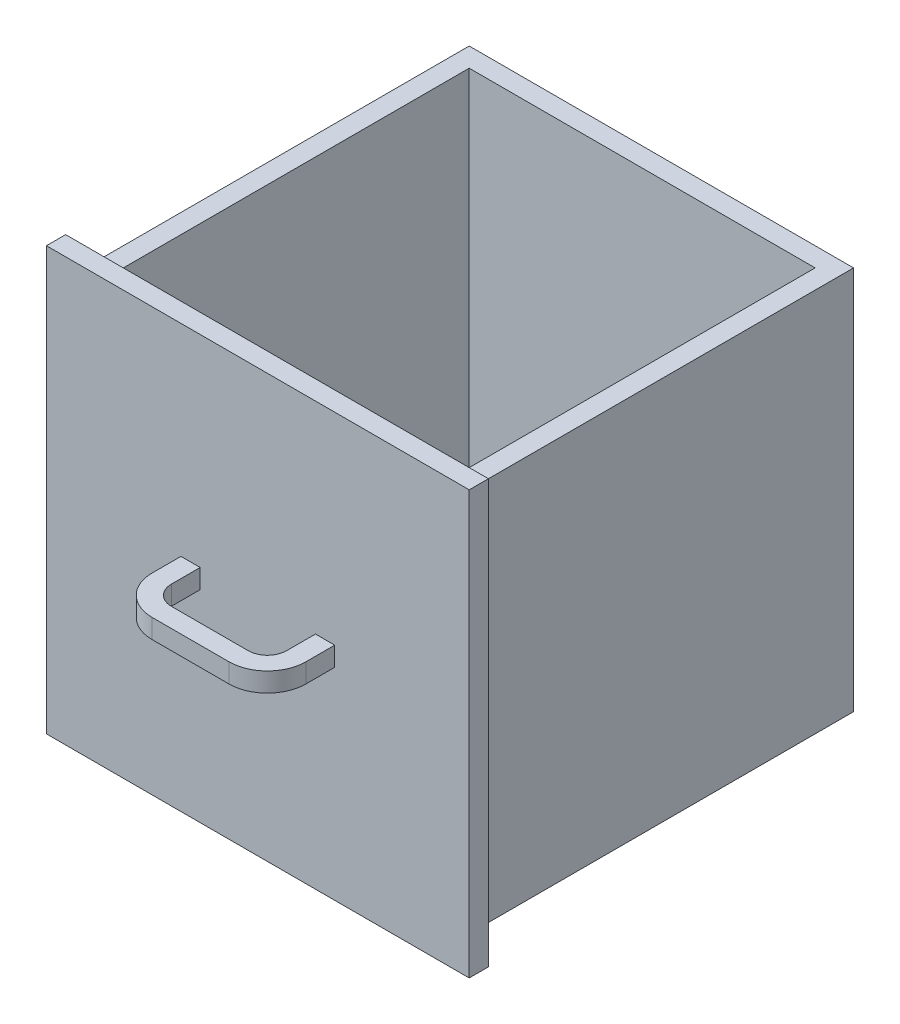
ISO-10303-21;
HEADER;
FILE_DESCRIPTION(('STEP AP214'),'2;1');
FILE_NAME('part.step','',(''),(''),'','','');
FILE_SCHEMA(('AUTOMOTIVE_DESIGN { 1 0 10303 214 1 1 1 1 }'));
ENDSEC;
DATA;
#1=APPLICATION_CONTEXT('core data for automotive mechanical design processes');
#2=APPLICATION_PROTOCOL_DEFINITION('international standard','automotive_design',2000,#1);
#3=PRODUCT_CONTEXT('',#1,'mechanical');
#4=PRODUCT('Part','Part','',(#3));
#5=PRODUCT_RELATED_PRODUCT_CATEGORY('part','',(#4));
#6=PRODUCT_DEFINITION_FORMATION('','',#4);
#7=PRODUCT_DEFINITION_CONTEXT('part definition',#1,'design');
#8=PRODUCT_DEFINITION('design','',#6,#7);
#9=PRODUCT_DEFINITION_SHAPE('','',#8);
#10=(LENGTH_UNIT() NAMED_UNIT(*) SI_UNIT(.MILLI.,.METRE.));
#11=(NAMED_UNIT(*) PLANE_ANGLE_UNIT() SI_UNIT($,.RADIAN.));
#12=(NAMED_UNIT(*) SI_UNIT($,.STERADIAN.) SOLID_ANGLE_UNIT());
#13=UNCERTAINTY_MEASURE_WITH_UNIT(LENGTH_MEASURE(1.E-05),#10,'distance_accuracy_value','');
#14=(GEOMETRIC_REPRESENTATION_CONTEXT(3) GLOBAL_UNCERTAINTY_ASSIGNED_CONTEXT((#13)) GLOBAL_UNIT_ASSIGNED_CONTEXT((#10,
#11,#12)) REPRESENTATION_CONTEXT('',''));
#15=CARTESIAN_POINT('',(0.,0.,0.));
#16=DIRECTION('',(0.,0.,1.));
#17=DIRECTION('',(1.,0.,0.));
#18=AXIS2_PLACEMENT_3D('',#15,#16,#17);
#19=CARTESIAN_POINT('',(0.,40.,40.));
#20=DIRECTION('',(0.,-1.,0.));
#21=DIRECTION('',(0.,0.,-1.));
#22=AXIS2_PLACEMENT_3D('',#19,#20,#21);
#23=PLANE('',#22);
#24=DIRECTION('',(-1.,0.,0.));
#25=VECTOR('',#24,1.);
#26=CARTESIAN_POINT('',(0.,40.,0.));
#27=LINE('',#26,#25);
#28=CARTESIAN_POINT('',(40.,40.,0.));
#29=VERTEX_POINT('',#28);
#30=CARTESIAN_POINT('',(0.,40.,0.));
#31=VERTEX_POINT('',#30);
#32=EDGE_CURVE('E361',#29,#31,#27,.T.);
#33=ORIENTED_EDGE('',*,*,#32,.T.);
#34=DIRECTION('',(0.,0.,-1.));
#35=VECTOR('',#34,1.);
#36=CARTESIAN_POINT('',(0.,40.,40.));
#37=LINE('',#36,#35);
#38=CARTESIAN_POINT('',(0.,40.,40.));
#39=VERTEX_POINT('',#38);
#40=EDGE_CURVE('E370',#39,#31,#37,.T.);
#41=ORIENTED_EDGE('',*,*,#40,.F.);
#42=DIRECTION('',(-1.,0.,0.));
#43=VECTOR('',#42,1.);
#44=CARTESIAN_POINT('',(0.,40.,40.));
#45=LINE('',#44,#43);
#46=CARTESIAN_POINT('',(40.,40.,40.));
#47=VERTEX_POINT('',#46);
#48=EDGE_CURVE('E367',#47,#39,#45,.T.);
#49=ORIENTED_EDGE('',*,*,#48,.F.);
#50=DIRECTION('',(0.,0.,-1.));
#51=VECTOR('',#50,1.);
#52=CARTESIAN_POINT('',(40.,40.,40.));
#53=LINE('',#52,#51);
#54=EDGE_CURVE('E380',#47,#29,#53,.T.);
#55=ORIENTED_EDGE('',*,*,#54,.T.);
#56=EDGE_LOOP('',(#33,#41,#49,#55));
#57=FACE_BOUND('',#56,.T.);
#58=DIRECTION('',(-1.,0.,0.));
#59=VECTOR('',#58,1.);
#60=CARTESIAN_POINT('',(0.,40.,2.));
#61=LINE('',#60,#59);
#62=CARTESIAN_POINT('',(38.,40.,2.));
#63=VERTEX_POINT('',#62);
#64=CARTESIAN_POINT('',(2.,40.,2.));
#65=VERTEX_POINT('',#64);
#66=EDGE_CURVE('E337',#63,#65,#61,.T.);
#67=ORIENTED_EDGE('',*,*,#66,.F.);
#68=DIRECTION('',(0.,0.,-1.));
#69=VECTOR('',#68,1.);
#70=CARTESIAN_POINT('',(38.,40.,40.));
#71=LINE('',#70,#69);
#72=CARTESIAN_POINT('',(38.,40.,38.));
#73=VERTEX_POINT('',#72);
#74=EDGE_CURVE('E342',#73,#63,#71,.T.);
#75=ORIENTED_EDGE('',*,*,#74,.F.);
#76=DIRECTION('',(-1.,0.,0.));
#77=VECTOR('',#76,1.);
#78=CARTESIAN_POINT('',(0.,40.,38.));
#79=LINE('',#78,#77);
#80=CARTESIAN_POINT('',(2.,40.,38.));
#81=VERTEX_POINT('',#80);
#82=EDGE_CURVE('E348',#73,#81,#79,.T.);
#83=ORIENTED_EDGE('',*,*,#82,.T.);
#84=DIRECTION('',(0.,0.,-1.));
#85=VECTOR('',#84,1.);
#86=CARTESIAN_POINT('',(2.,40.,40.));
#87=LINE('',#86,#85);
#88=EDGE_CURVE('E349',#81,#65,#87,.T.);
#89=ORIENTED_EDGE('',*,*,#88,.T.);
#90=EDGE_LOOP('',(#67,#75,#83,#89));
#91=FACE_BOUND('',#90,.T.);
#92=ADVANCED_FACE('F32',(#57,#91),#23,.F.);
#93=CARTESIAN_POINT('',(0.,0.,40.));
#94=DIRECTION('',(1.,0.,0.));
#95=DIRECTION('',(0.,0.,-1.));
#96=AXIS2_PLACEMENT_3D('',#93,#94,#95);
#97=PLANE('',#96);
#98=DIRECTION('',(0.,-1.,0.));
#99=VECTOR('',#98,1.);
#100=CARTESIAN_POINT('',(0.,0.,0.));
#101=LINE('',#100,#99);
#102=CARTESIAN_POINT('',(0.,0.,0.));
#103=VERTEX_POINT('',#102);
#104=EDGE_CURVE('E331',#31,#103,#101,.T.);
#105=ORIENTED_EDGE('',*,*,#104,.T.);
#106=DIRECTION('',(0.,0.,-1.));
#107=VECTOR('',#106,1.);
#108=CARTESIAN_POINT('',(0.,0.,40.));
#109=LINE('',#108,#107);
#110=CARTESIAN_POINT('',(0.,0.,40.));
#111=VERTEX_POINT('',#110);
#112=EDGE_CURVE('E11',#111,#103,#109,.T.);
#113=ORIENTED_EDGE('',*,*,#112,.F.);
#114=DIRECTION('',(0.,-1.,0.));
#115=VECTOR('',#114,1.);
#116=CARTESIAN_POINT('',(0.,0.,40.));
#117=LINE('',#116,#115);
#118=EDGE_CURVE('E357',#39,#111,#117,.T.);
#119=ORIENTED_EDGE('',*,*,#118,.F.);
#120=ORIENTED_EDGE('',*,*,#40,.T.);
#121=EDGE_LOOP('',(#105,#113,#119,#120));
#122=FACE_BOUND('',#121,.T.);
#123=ADVANCED_FACE('F34',(#122),#97,.F.);
#124=CARTESIAN_POINT('',(0.,0.,40.));
#125=DIRECTION('',(0.,1.,0.));
#126=DIRECTION('',(0.,0.,1.));
#127=AXIS2_PLACEMENT_3D('',#124,#125,#126);
#128=PLANE('',#127);
#129=DIRECTION('',(1.,0.,0.));
#130=VECTOR('',#129,1.);
#131=CARTESIAN_POINT('',(0.,0.,0.));
#132=LINE('',#131,#130);
#133=CARTESIAN_POINT('',(40.,0.,0.));
#134=VERTEX_POINT('',#133);
#135=EDGE_CURVE('E373',#103,#134,#132,.T.);
#136=ORIENTED_EDGE('',*,*,#135,.T.);
#137=DIRECTION('',(0.,0.,-1.));
#138=VECTOR('',#137,1.);
#139=CARTESIAN_POINT('',(40.,0.,40.));
#140=LINE('',#139,#138);
#141=CARTESIAN_POINT('',(40.,0.,40.));
#142=VERTEX_POINT('',#141);
#143=EDGE_CURVE('E40',#142,#134,#140,.T.);
#144=ORIENTED_EDGE('',*,*,#143,.F.);
#145=DIRECTION('',(1.,0.,0.));
#146=VECTOR('',#145,1.);
#147=CARTESIAN_POINT('',(0.,0.,40.));
#148=LINE('',#147,#146);
#149=EDGE_CURVE('E360',#111,#142,#148,.T.);
#150=ORIENTED_EDGE('',*,*,#149,.F.);
#151=ORIENTED_EDGE('',*,*,#112,.T.);
#152=EDGE_LOOP('',(#136,#144,#150,#151));
#153=FACE_BOUND('',#152,.T.);
#154=ADVANCED_FACE('F400',(#153),#128,.F.);
#155=CARTESIAN_POINT('',(40.,0.,40.));
#156=DIRECTION('',(-1.,0.,0.));
#157=DIRECTION('',(0.,0.,1.));
#158=AXIS2_PLACEMENT_3D('',#155,#156,#157);
#159=PLANE('',#158);
#160=DIRECTION('',(0.,1.,0.));
#161=VECTOR('',#160,1.);
#162=CARTESIAN_POINT('',(40.,0.,0.));
#163=LINE('',#162,#161);
#164=EDGE_CURVE('E375',#134,#29,#163,.T.);
#165=ORIENTED_EDGE('',*,*,#164,.T.);
#166=ORIENTED_EDGE('',*,*,#54,.F.);
#167=DIRECTION('',(0.,1.,0.));
#168=VECTOR('',#167,1.);
#169=CARTESIAN_POINT('',(40.,0.,40.));
#170=LINE('',#169,#168);
#171=EDGE_CURVE('E364',#142,#47,#170,.T.);
#172=ORIENTED_EDGE('',*,*,#171,.F.);
#173=ORIENTED_EDGE('',*,*,#143,.T.);
#174=EDGE_LOOP('',(#165,#166,#172,#173));
#175=FACE_BOUND('',#174,.T.);
#176=ADVANCED_FACE('F386',(#175),#159,.F.);
#177=CARTESIAN_POINT('',(0.,0.,0.));
#178=DIRECTION('',(0.,0.,-1.));
#179=DIRECTION('',(-1.,0.,0.));
#180=AXIS2_PLACEMENT_3D('',#177,#178,#179);
#181=PLANE('',#180);
#182=ORIENTED_EDGE('',*,*,#104,.F.);
#183=ORIENTED_EDGE('',*,*,#32,.F.);
#184=ORIENTED_EDGE('',*,*,#164,.F.);
#185=ORIENTED_EDGE('',*,*,#135,.F.);
#186=EDGE_LOOP('',(#182,#183,#184,#185));
#187=FACE_BOUND('',#186,.T.);
#188=ADVANCED_FACE('F392',(#187),#181,.T.);
#189=CARTESIAN_POINT('',(2.,0.,40.));
#190=DIRECTION('',(1.,0.,0.));
#191=DIRECTION('',(0.,0.,-1.));
#192=AXIS2_PLACEMENT_3D('',#189,#190,#191);
#193=PLANE('',#192);
#194=DIRECTION('',(0.,-1.,0.));
#195=VECTOR('',#194,1.);
#196=CARTESIAN_POINT('',(2.,0.,2.));
#197=LINE('',#196,#195);
#198=CARTESIAN_POINT('',(2.,2.,2.));
#199=VERTEX_POINT('',#198);
#200=EDGE_CURVE('E324',#65,#199,#197,.T.);
#201=ORIENTED_EDGE('',*,*,#200,.F.);
#202=ORIENTED_EDGE('',*,*,#88,.F.);
#203=DIRECTION('',(0.,-1.,0.));
#204=VECTOR('',#203,1.);
#205=CARTESIAN_POINT('',(2.,0.,38.));
#206=LINE('',#205,#204);
#207=CARTESIAN_POINT('',(2.,2.,38.));
#208=VERTEX_POINT('',#207);
#209=EDGE_CURVE('E333',#81,#208,#206,.T.);
#210=ORIENTED_EDGE('',*,*,#209,.T.);
#211=DIRECTION('',(0.,0.,-1.));
#212=VECTOR('',#211,1.);
#213=CARTESIAN_POINT('',(2.,2.,40.));
#214=LINE('',#213,#212);
#215=EDGE_CURVE('E328',#208,#199,#214,.T.);
#216=ORIENTED_EDGE('',*,*,#215,.T.);
#217=EDGE_LOOP('',(#201,#202,#210,#216));
#218=FACE_BOUND('',#217,.T.);
#219=ADVANCED_FACE('F414',(#218),#193,.T.);
#220=CARTESIAN_POINT('',(0.,2.,40.));
#221=DIRECTION('',(0.,1.,0.));
#222=DIRECTION('',(0.,0.,1.));
#223=AXIS2_PLACEMENT_3D('',#220,#221,#222);
#224=PLANE('',#223);
#225=DIRECTION('',(1.,0.,0.));
#226=VECTOR('',#225,1.);
#227=CARTESIAN_POINT('',(0.,2.,2.));
#228=LINE('',#227,#226);
#229=CARTESIAN_POINT('',(38.,2.,2.));
#230=VERTEX_POINT('',#229);
#231=EDGE_CURVE('E327',#199,#230,#228,.T.);
#232=ORIENTED_EDGE('',*,*,#231,.F.);
#233=ORIENTED_EDGE('',*,*,#215,.F.);
#234=DIRECTION('',(1.,0.,0.));
#235=VECTOR('',#234,1.);
#236=CARTESIAN_POINT('',(0.,2.,38.));
#237=LINE('',#236,#235);
#238=CARTESIAN_POINT('',(38.,2.,38.));
#239=VERTEX_POINT('',#238);
#240=EDGE_CURVE('E336',#208,#239,#237,.T.);
#241=ORIENTED_EDGE('',*,*,#240,.T.);
#242=DIRECTION('',(0.,0.,-1.));
#243=VECTOR('',#242,1.);
#244=CARTESIAN_POINT('',(38.,2.,40.));
#245=LINE('',#244,#243);
#246=EDGE_CURVE('E332',#239,#230,#245,.T.);
#247=ORIENTED_EDGE('',*,*,#246,.T.);
#248=EDGE_LOOP('',(#232,#233,#241,#247));
#249=FACE_BOUND('',#248,.T.);
#250=ADVANCED_FACE('F426',(#249),#224,.T.);
#251=CARTESIAN_POINT('',(38.,0.,40.));
#252=DIRECTION('',(-1.,0.,0.));
#253=DIRECTION('',(0.,0.,1.));
#254=AXIS2_PLACEMENT_3D('',#251,#252,#253);
#255=PLANE('',#254);
#256=DIRECTION('',(0.,1.,0.));
#257=VECTOR('',#256,1.);
#258=CARTESIAN_POINT('',(38.,0.,2.));
#259=LINE('',#258,#257);
#260=EDGE_CURVE('E339',#230,#63,#259,.T.);
#261=ORIENTED_EDGE('',*,*,#260,.F.);
#262=ORIENTED_EDGE('',*,*,#246,.F.);
#263=DIRECTION('',(0.,1.,0.));
#264=VECTOR('',#263,1.);
#265=CARTESIAN_POINT('',(38.,0.,38.));
#266=LINE('',#265,#264);
#267=EDGE_CURVE('E344',#239,#73,#266,.T.);
#268=ORIENTED_EDGE('',*,*,#267,.T.);
#269=ORIENTED_EDGE('',*,*,#74,.T.);
#270=EDGE_LOOP('',(#261,#262,#268,#269));
#271=FACE_BOUND('',#270,.T.);
#272=ADVANCED_FACE('F422',(#271),#255,.T.);
#273=CARTESIAN_POINT('',(0.,0.,38.));
#274=DIRECTION('',(0.,0.,-1.));
#275=DIRECTION('',(-1.,0.,0.));
#276=AXIS2_PLACEMENT_3D('',#273,#274,#275);
#277=PLANE('',#276);
#278=ORIENTED_EDGE('',*,*,#209,.F.);
#279=ORIENTED_EDGE('',*,*,#82,.F.);
#280=ORIENTED_EDGE('',*,*,#267,.F.);
#281=ORIENTED_EDGE('',*,*,#240,.F.);
#282=EDGE_LOOP('',(#278,#279,#280,#281));
#283=FACE_BOUND('',#282,.T.);
#284=ADVANCED_FACE('F418',(#283),#277,.T.);
#285=CARTESIAN_POINT('',(0.,0.,2.));
#286=DIRECTION('',(0.,0.,-1.));
#287=DIRECTION('',(-1.,0.,0.));
#288=AXIS2_PLACEMENT_3D('',#285,#286,#287);
#289=PLANE('',#288);
#290=ORIENTED_EDGE('',*,*,#200,.T.);
#291=ORIENTED_EDGE('',*,*,#231,.T.);
#292=ORIENTED_EDGE('',*,*,#260,.T.);
#293=ORIENTED_EDGE('',*,*,#66,.T.);
#294=EDGE_LOOP('',(#290,#291,#292,#293));
#295=FACE_BOUND('',#294,.T.);
#296=ADVANCED_FACE('F415',(#295),#289,.F.);
#297=CARTESIAN_POINT('',(0.,0.,40.));
#298=DIRECTION('',(0.,0.,1.));
#299=DIRECTION('',(1.,0.,0.));
#300=AXIS2_PLACEMENT_3D('',#297,#298,#299);
#301=PLANE('',#300);
#302=DIRECTION('',(-1.,0.,0.));
#303=VECTOR('',#302,1.);
#304=CARTESIAN_POINT('',(42.,42.,40.));
#305=LINE('',#304,#303);
#306=CARTESIAN_POINT('',(42.,42.,40.));
#307=VERTEX_POINT('',#306);
#308=CARTESIAN_POINT('',(-2.,42.,40.));
#309=VERTEX_POINT('',#308);
#310=EDGE_CURVE('E215',#307,#309,#305,.T.);
#311=ORIENTED_EDGE('',*,*,#310,.F.);
#312=DIRECTION('',(0.,1.,0.));
#313=VECTOR('',#312,1.);
#314=CARTESIAN_POINT('',(42.,-2.,40.));
#315=LINE('',#314,#313);
#316=CARTESIAN_POINT('',(42.,-2.,40.));
#317=VERTEX_POINT('',#316);
#318=EDGE_CURVE('E299',#317,#307,#315,.T.);
#319=ORIENTED_EDGE('',*,*,#318,.F.);
#320=DIRECTION('',(1.,0.,0.));
#321=VECTOR('',#320,1.);
#322=CARTESIAN_POINT('',(-2.,-2.,40.));
#323=LINE('',#322,#321);
#324=CARTESIAN_POINT('',(-2.,-2.,40.));
#325=VERTEX_POINT('',#324);
#326=EDGE_CURVE('E310',#325,#317,#323,.T.);
#327=ORIENTED_EDGE('',*,*,#326,.F.);
#328=DIRECTION('',(0.,-1.,0.));
#329=VECTOR('',#328,1.);
#330=CARTESIAN_POINT('',(-2.,42.,40.));
#331=LINE('',#330,#329);
#332=EDGE_CURVE('E308',#309,#325,#331,.T.);
#333=ORIENTED_EDGE('',*,*,#332,.F.);
#334=EDGE_LOOP('',(#311,#319,#327,#333));
#335=FACE_BOUND('',#334,.T.);
#336=ORIENTED_EDGE('',*,*,#171,.T.);
#337=ORIENTED_EDGE('',*,*,#48,.T.);
#338=ORIENTED_EDGE('',*,*,#118,.T.);
#339=ORIENTED_EDGE('',*,*,#149,.T.);
#340=EDGE_LOOP('',(#336,#337,#338,#339));
#341=FACE_BOUND('',#340,.T.);
#342=ADVANCED_FACE('F399',(#335,#341),#301,.F.);
#343=CARTESIAN_POINT('',(42.,42.,42.));
#344=DIRECTION('',(0.,-1.,0.));
#345=DIRECTION('',(0.,0.,-1.));
#346=AXIS2_PLACEMENT_3D('',#343,#344,#345);
#347=PLANE('',#346);
#348=ORIENTED_EDGE('',*,*,#310,.T.);
#349=DIRECTION('',(0.,0.,-1.));
#350=VECTOR('',#349,1.);
#351=CARTESIAN_POINT('',(-2.,42.,42.));
#352=LINE('',#351,#350);
#353=CARTESIAN_POINT('',(-2.,42.,42.));
#354=VERTEX_POINT('',#353);
#355=EDGE_CURVE('E321',#354,#309,#352,.T.);
#356=ORIENTED_EDGE('',*,*,#355,.F.);
#357=DIRECTION('',(-1.,0.,0.));
#358=VECTOR('',#357,1.);
#359=CARTESIAN_POINT('',(42.,42.,42.));
#360=LINE('',#359,#358);
#361=CARTESIAN_POINT('',(42.,42.,42.));
#362=VERTEX_POINT('',#361);
#363=EDGE_CURVE('E295',#362,#354,#360,.T.);
#364=ORIENTED_EDGE('',*,*,#363,.F.);
#365=DIRECTION('',(0.,0.,-1.));
#366=VECTOR('',#365,1.);
#367=CARTESIAN_POINT('',(42.,42.,42.));
#368=LINE('',#367,#366);
#369=EDGE_CURVE('E305',#362,#307,#368,.T.);
#370=ORIENTED_EDGE('',*,*,#369,.T.);
#371=EDGE_LOOP('',(#348,#356,#364,#370));
#372=FACE_BOUND('',#371,.T.);
#373=ADVANCED_FACE('F434',(#372),#347,.F.);
#374=CARTESIAN_POINT('',(-2.,42.,42.));
#375=DIRECTION('',(1.,0.,0.));
#376=DIRECTION('',(0.,0.,-1.));
#377=AXIS2_PLACEMENT_3D('',#374,#375,#376);
#378=PLANE('',#377);
#379=ORIENTED_EDGE('',*,*,#332,.T.);
#380=DIRECTION('',(0.,0.,-1.));
#381=VECTOR('',#380,1.);
#382=CARTESIAN_POINT('',(-2.,-2.,42.));
#383=LINE('',#382,#381);
#384=CARTESIAN_POINT('',(-2.,-2.,42.));
#385=VERTEX_POINT('',#384);
#386=EDGE_CURVE('E318',#385,#325,#383,.T.);
#387=ORIENTED_EDGE('',*,*,#386,.F.);
#388=DIRECTION('',(0.,-1.,0.));
#389=VECTOR('',#388,1.);
#390=CARTESIAN_POINT('',(-2.,42.,42.));
#391=LINE('',#390,#389);
#392=EDGE_CURVE('E298',#354,#385,#391,.T.);
#393=ORIENTED_EDGE('',*,*,#392,.F.);
#394=ORIENTED_EDGE('',*,*,#355,.T.);
#395=EDGE_LOOP('',(#379,#387,#393,#394));
#396=FACE_BOUND('',#395,.T.);
#397=ADVANCED_FACE('F437',(#396),#378,.F.);
#398=CARTESIAN_POINT('',(-2.,-2.,42.));
#399=DIRECTION('',(0.,1.,0.));
#400=DIRECTION('',(0.,0.,1.));
#401=AXIS2_PLACEMENT_3D('',#398,#399,#400);
#402=PLANE('',#401);
#403=ORIENTED_EDGE('',*,*,#326,.T.);
#404=DIRECTION('',(0.,0.,-1.));
#405=VECTOR('',#404,1.);
#406=CARTESIAN_POINT('',(42.,-2.,42.));
#407=LINE('',#406,#405);
#408=CARTESIAN_POINT('',(42.,-2.,42.));
#409=VERTEX_POINT('',#408);
#410=EDGE_CURVE('E315',#409,#317,#407,.T.);
#411=ORIENTED_EDGE('',*,*,#410,.F.);
#412=DIRECTION('',(1.,0.,0.));
#413=VECTOR('',#412,1.);
#414=CARTESIAN_POINT('',(-2.,-2.,42.));
#415=LINE('',#414,#413);
#416=EDGE_CURVE('E301',#385,#409,#415,.T.);
#417=ORIENTED_EDGE('',*,*,#416,.F.);
#418=ORIENTED_EDGE('',*,*,#386,.T.);
#419=EDGE_LOOP('',(#403,#411,#417,#418));
#420=FACE_BOUND('',#419,.T.);
#421=ADVANCED_FACE('F441',(#420),#402,.F.);
#422=CARTESIAN_POINT('',(42.,-2.,42.));
#423=DIRECTION('',(-1.,0.,0.));
#424=DIRECTION('',(0.,0.,1.));
#425=AXIS2_PLACEMENT_3D('',#422,#423,#424);
#426=PLANE('',#425);
#427=ORIENTED_EDGE('',*,*,#318,.T.);
#428=ORIENTED_EDGE('',*,*,#369,.F.);
#429=DIRECTION('',(0.,1.,0.));
#430=VECTOR('',#429,1.);
#431=CARTESIAN_POINT('',(42.,-2.,42.));
#432=LINE('',#431,#430);
#433=EDGE_CURVE('E303',#409,#362,#432,.T.);
#434=ORIENTED_EDGE('',*,*,#433,.F.);
#435=ORIENTED_EDGE('',*,*,#410,.T.);
#436=EDGE_LOOP('',(#427,#428,#434,#435));
#437=FACE_BOUND('',#436,.T.);
#438=ADVANCED_FACE('F445',(#437),#426,.F.);
#439=CARTESIAN_POINT('',(0.,0.,42.));
#440=DIRECTION('',(0.,0.,1.));
#441=DIRECTION('',(1.,0.,0.));
#442=AXIS2_PLACEMENT_3D('',#439,#440,#441);
#443=PLANE('',#442);
#444=DIRECTION('',(1.,0.,0.));
#445=VECTOR('',#444,1.);
#446=CARTESIAN_POINT('',(26.,21.,42.));
#447=LINE('',#446,#445);
#448=CARTESIAN_POINT('',(26.,21.,42.));
#449=VERTEX_POINT('',#448);
#450=CARTESIAN_POINT('',(28.,21.,42.));
#451=VERTEX_POINT('',#450);
#452=EDGE_CURVE('E199',#449,#451,#447,.T.);
#453=ORIENTED_EDGE('',*,*,#452,.T.);
#454=DIRECTION('',(0.,-1.,0.));
#455=VECTOR('',#454,1.);
#456=CARTESIAN_POINT('',(28.,21.,42.));
#457=LINE('',#456,#455);
#458=CARTESIAN_POINT('',(28.,19.,42.));
#459=VERTEX_POINT('',#458);
#460=EDGE_CURVE('E209',#451,#459,#457,.T.);
#461=ORIENTED_EDGE('',*,*,#460,.T.);
#462=DIRECTION('',(1.,0.,0.));
#463=VECTOR('',#462,1.);
#464=CARTESIAN_POINT('',(26.,19.,42.));
#465=LINE('',#464,#463);
#466=CARTESIAN_POINT('',(26.,19.,42.));
#467=VERTEX_POINT('',#466);
#468=EDGE_CURVE('E249',#467,#459,#465,.T.);
#469=ORIENTED_EDGE('',*,*,#468,.F.);
#470=DIRECTION('',(0.,-1.,0.));
#471=VECTOR('',#470,1.);
#472=CARTESIAN_POINT('',(26.,21.,42.));
#473=LINE('',#472,#471);
#474=EDGE_CURVE('E216',#449,#467,#473,.T.);
#475=ORIENTED_EDGE('',*,*,#474,.F.);
#476=EDGE_LOOP('',(#453,#461,#469,#475));
#477=FACE_BOUND('',#476,.T.);
#478=DIRECTION('',(1.,0.,0.));
#479=VECTOR('',#478,1.);
#480=CARTESIAN_POINT('',(12.,21.,42.));
#481=LINE('',#480,#479);
#482=CARTESIAN_POINT('',(12.,21.,42.));
#483=VERTEX_POINT('',#482);
#484=CARTESIAN_POINT('',(14.,21.,42.));
#485=VERTEX_POINT('',#484);
#486=EDGE_CURVE('E237',#483,#485,#481,.T.);
#487=ORIENTED_EDGE('',*,*,#486,.T.);
#488=DIRECTION('',(0.,-1.,0.));
#489=VECTOR('',#488,1.);
#490=CARTESIAN_POINT('',(14.,21.,42.));
#491=LINE('',#490,#489);
#492=CARTESIAN_POINT('',(14.,19.,42.));
#493=VERTEX_POINT('',#492);
#494=EDGE_CURVE('E283',#485,#493,#491,.T.);
#495=ORIENTED_EDGE('',*,*,#494,.T.);
#496=DIRECTION('',(1.,0.,0.));
#497=VECTOR('',#496,1.);
#498=CARTESIAN_POINT('',(12.,19.,42.));
#499=LINE('',#498,#497);
#500=CARTESIAN_POINT('',(12.,19.,42.));
#501=VERTEX_POINT('',#500);
#502=EDGE_CURVE('E263',#501,#493,#499,.T.);
#503=ORIENTED_EDGE('',*,*,#502,.F.);
#504=DIRECTION('',(0.,-1.,0.));
#505=VECTOR('',#504,1.);
#506=CARTESIAN_POINT('',(12.,21.,42.));
#507=LINE('',#506,#505);
#508=EDGE_CURVE('E281',#483,#501,#507,.T.);
#509=ORIENTED_EDGE('',*,*,#508,.F.);
#510=EDGE_LOOP('',(#487,#495,#503,#509));
#511=FACE_BOUND('',#510,.T.);
#512=ORIENTED_EDGE('',*,*,#363,.T.);
#513=ORIENTED_EDGE('',*,*,#392,.T.);
#514=ORIENTED_EDGE('',*,*,#416,.T.);
#515=ORIENTED_EDGE('',*,*,#433,.T.);
#516=EDGE_LOOP('',(#512,#513,#514,#515));
#517=FACE_BOUND('',#516,.T.);
#518=ADVANCED_FACE('F219',(#477,#511,#517),#443,.T.);
#519=CARTESIAN_POINT('',(28.,21.,45.));
#520=DIRECTION('',(-1.,0.,0.));
#521=DIRECTION('',(0.,0.,1.));
#522=AXIS2_PLACEMENT_3D('',#519,#520,#521);
#523=PLANE('',#522);
#524=DIRECTION('',(0.,0.,-1.));
#525=VECTOR('',#524,1.);
#526=CARTESIAN_POINT('',(28.,19.,45.));
#527=LINE('',#526,#525);
#528=CARTESIAN_POINT('',(28.,19.,45.));
#529=VERTEX_POINT('',#528);
#530=EDGE_CURVE('E212',#529,#459,#527,.T.);
#531=ORIENTED_EDGE('',*,*,#530,.T.);
#532=ORIENTED_EDGE('',*,*,#460,.F.);
#533=DIRECTION('',(0.,0.,-1.));
#534=VECTOR('',#533,1.);
#535=CARTESIAN_POINT('',(28.,21.,45.));
#536=LINE('',#535,#534);
#537=CARTESIAN_POINT('',(28.,21.,45.));
#538=VERTEX_POINT('',#537);
#539=EDGE_CURVE('E194',#538,#451,#536,.T.);
#540=ORIENTED_EDGE('',*,*,#539,.F.);
#541=DIRECTION('',(0.,-1.,0.));
#542=VECTOR('',#541,1.);
#543=CARTESIAN_POINT('',(28.,21.,45.));
#544=LINE('',#543,#542);
#545=EDGE_CURVE('E247',#538,#529,#544,.T.);
#546=ORIENTED_EDGE('',*,*,#545,.T.);
#547=EDGE_LOOP('',(#531,#532,#540,#546));
#548=FACE_BOUND('',#547,.T.);
#549=ADVANCED_FACE('F210',(#548),#523,.F.);
#550=CARTESIAN_POINT('',(26.,21.,45.));
#551=DIRECTION('',(-1.,0.,0.));
#552=DIRECTION('',(0.,0.,1.));
#553=AXIS2_PLACEMENT_3D('',#550,#551,#552);
#554=PLANE('',#553);
#555=DIRECTION('',(0.,0.,-1.));
#556=VECTOR('',#555,1.);
#557=CARTESIAN_POINT('',(26.,19.,45.));
#558=LINE('',#557,#556);
#559=CARTESIAN_POINT('',(26.,19.,45.));
#560=VERTEX_POINT('',#559);
#561=EDGE_CURVE('E47',#560,#467,#558,.T.);
#562=ORIENTED_EDGE('',*,*,#561,.F.);
#563=DIRECTION('',(0.,-1.,0.));
#564=VECTOR('',#563,1.);
#565=CARTESIAN_POINT('',(26.,21.,45.));
#566=LINE('',#565,#564);
#567=CARTESIAN_POINT('',(26.,21.,45.));
#568=VERTEX_POINT('',#567);
#569=EDGE_CURVE('E292',#568,#560,#566,.T.);
#570=ORIENTED_EDGE('',*,*,#569,.F.);
#571=DIRECTION('',(0.,0.,-1.));
#572=VECTOR('',#571,1.);
#573=CARTESIAN_POINT('',(26.,21.,45.));
#574=LINE('',#573,#572);
#575=EDGE_CURVE('E221',#568,#449,#574,.T.);
#576=ORIENTED_EDGE('',*,*,#575,.T.);
#577=ORIENTED_EDGE('',*,*,#474,.T.);
#578=EDGE_LOOP('',(#562,#570,#576,#577));
#579=FACE_BOUND('',#578,.T.);
#580=ADVANCED_FACE('F457',(#579),#554,.T.);
#581=CARTESIAN_POINT('',(24.,21.,45.));
#582=DIRECTION('',(0.,-1.,0.));
#583=DIRECTION('',(0.,0.,-1.));
#584=AXIS2_PLACEMENT_3D('',#581,#582,#583);
#585=CYLINDRICAL_SURFACE('',#584,2.);
#586=CARTESIAN_POINT('',(24.,19.,45.));
#587=DIRECTION('',(0.,1.,0.));
#588=DIRECTION('',(0.,0.,1.));
#589=AXIS2_PLACEMENT_3D('',#586,#587,#588);
#590=CIRCLE('',#589,2.);
#591=CARTESIAN_POINT('',(24.,19.,47.));
#592=VERTEX_POINT('',#591);
#593=EDGE_CURVE('E252',#592,#560,#590,.T.);
#594=ORIENTED_EDGE('',*,*,#593,.F.);
#595=DIRECTION('',(0.,-1.,0.));
#596=VECTOR('',#595,1.);
#597=CARTESIAN_POINT('',(24.,21.,47.));
#598=LINE('',#597,#596);
#599=CARTESIAN_POINT('',(24.,21.,47.));
#600=VERTEX_POINT('',#599);
#601=EDGE_CURVE('E290',#600,#592,#598,.T.);
#602=ORIENTED_EDGE('',*,*,#601,.F.);
#603=CARTESIAN_POINT('',(24.,21.,45.));
#604=DIRECTION('',(0.,1.,0.));
#605=DIRECTION('',(0.,0.,1.));
#606=AXIS2_PLACEMENT_3D('',#603,#604,#605);
#607=CIRCLE('',#606,2.);
#608=EDGE_CURVE('E223',#600,#568,#607,.T.);
#609=ORIENTED_EDGE('',*,*,#608,.T.);
#610=ORIENTED_EDGE('',*,*,#569,.T.);
#611=EDGE_LOOP('',(#594,#602,#609,#610));
#612=FACE_BOUND('',#611,.T.);
#613=ADVANCED_FACE('F460',(#612),#585,.F.);
#614=CARTESIAN_POINT('',(16.,21.,47.));
#615=DIRECTION('',(0.,0.,-1.));
#616=DIRECTION('',(-1.,0.,0.));
#617=AXIS2_PLACEMENT_3D('',#614,#615,#616);
#618=PLANE('',#617);
#619=DIRECTION('',(1.,0.,0.));
#620=VECTOR('',#619,1.);
#621=CARTESIAN_POINT('',(16.,19.,47.));
#622=LINE('',#621,#620);
#623=CARTESIAN_POINT('',(16.,19.,47.));
#624=VERTEX_POINT('',#623);
#625=EDGE_CURVE('E254',#624,#592,#622,.T.);
#626=ORIENTED_EDGE('',*,*,#625,.F.);
#627=DIRECTION('',(0.,-1.,0.));
#628=VECTOR('',#627,1.);
#629=CARTESIAN_POINT('',(16.,21.,47.));
#630=LINE('',#629,#628);
#631=CARTESIAN_POINT('',(16.,21.,47.));
#632=VERTEX_POINT('',#631);
#633=EDGE_CURVE('E288',#632,#624,#630,.T.);
#634=ORIENTED_EDGE('',*,*,#633,.F.);
#635=DIRECTION('',(1.,0.,0.));
#636=VECTOR('',#635,1.);
#637=CARTESIAN_POINT('',(16.,21.,47.));
#638=LINE('',#637,#636);
#639=EDGE_CURVE('E228',#632,#600,#638,.T.);
#640=ORIENTED_EDGE('',*,*,#639,.T.);
#641=ORIENTED_EDGE('',*,*,#601,.T.);
#642=EDGE_LOOP('',(#626,#634,#640,#641));
#643=FACE_BOUND('',#642,.T.);
#644=ADVANCED_FACE('F464',(#643),#618,.T.);
#645=CARTESIAN_POINT('',(16.,21.,45.));
#646=DIRECTION('',(0.,-1.,0.));
#647=DIRECTION('',(0.,0.,-1.));
#648=AXIS2_PLACEMENT_3D('',#645,#646,#647);
#649=CYLINDRICAL_SURFACE('',#648,2.);
#650=CARTESIAN_POINT('',(16.,19.,45.));
#651=DIRECTION('',(0.,1.,0.));
#652=DIRECTION('',(0.,0.,1.));
#653=AXIS2_PLACEMENT_3D('',#650,#651,#652);
#654=CIRCLE('',#653,2.);
#655=CARTESIAN_POINT('',(14.,19.,45.));
#656=VERTEX_POINT('',#655);
#657=EDGE_CURVE('E257',#656,#624,#654,.T.);
#658=ORIENTED_EDGE('',*,*,#657,.F.);
#659=DIRECTION('',(0.,-1.,0.));
#660=VECTOR('',#659,1.);
#661=CARTESIAN_POINT('',(14.,21.,45.));
#662=LINE('',#661,#660);
#663=CARTESIAN_POINT('',(14.,21.,45.));
#664=VERTEX_POINT('',#663);
#665=EDGE_CURVE('E286',#664,#656,#662,.T.);
#666=ORIENTED_EDGE('',*,*,#665,.F.);
#667=CARTESIAN_POINT('',(16.,21.,45.));
#668=DIRECTION('',(0.,1.,0.));
#669=DIRECTION('',(0.,0.,1.));
#670=AXIS2_PLACEMENT_3D('',#667,#668,#669);
#671=CIRCLE('',#670,2.);
#672=EDGE_CURVE('E231',#664,#632,#671,.T.);
#673=ORIENTED_EDGE('',*,*,#672,.T.);
#674=ORIENTED_EDGE('',*,*,#633,.T.);
#675=EDGE_LOOP('',(#658,#666,#673,#674));
#676=FACE_BOUND('',#675,.T.);
#677=ADVANCED_FACE('F468',(#676),#649,.F.);
#678=CARTESIAN_POINT('',(14.,21.,42.));
#679=DIRECTION('',(1.,0.,0.));
#680=DIRECTION('',(0.,0.,-1.));
#681=AXIS2_PLACEMENT_3D('',#678,#679,#680);
#682=PLANE('',#681);
#683=DIRECTION('',(0.,0.,1.));
#684=VECTOR('',#683,1.);
#685=CARTESIAN_POINT('',(14.,19.,42.));
#686=LINE('',#685,#684);
#687=EDGE_CURVE('E260',#493,#656,#686,.T.);
#688=ORIENTED_EDGE('',*,*,#687,.F.);
#689=ORIENTED_EDGE('',*,*,#494,.F.);
#690=DIRECTION('',(0.,0.,1.));
#691=VECTOR('',#690,1.);
#692=CARTESIAN_POINT('',(14.,21.,42.));
#693=LINE('',#692,#691);
#694=EDGE_CURVE('E234',#485,#664,#693,.T.);
#695=ORIENTED_EDGE('',*,*,#694,.T.);
#696=ORIENTED_EDGE('',*,*,#665,.T.);
#697=EDGE_LOOP('',(#688,#689,#695,#696));
#698=FACE_BOUND('',#697,.T.);
#699=ADVANCED_FACE('F472',(#698),#682,.T.);
#700=CARTESIAN_POINT('',(12.,21.,42.));
#701=DIRECTION('',(1.,0.,0.));
#702=DIRECTION('',(0.,0.,-1.));
#703=AXIS2_PLACEMENT_3D('',#700,#701,#702);
#704=PLANE('',#703);
#705=DIRECTION('',(0.,0.,-1.));
#706=VECTOR('',#705,1.);
#707=CARTESIAN_POINT('',(12.,19.,42.));
#708=LINE('',#707,#706);
#709=CARTESIAN_POINT('',(12.,19.,45.));
#710=VERTEX_POINT('',#709);
#711=EDGE_CURVE('E54',#501,#710,#708,.F.);
#712=ORIENTED_EDGE('',*,*,#711,.T.);
#713=DIRECTION('',(0.,-1.,0.));
#714=VECTOR('',#713,1.);
#715=CARTESIAN_POINT('',(12.,21.,45.));
#716=LINE('',#715,#714);
#717=CARTESIAN_POINT('',(12.,21.,45.));
#718=VERTEX_POINT('',#717);
#719=EDGE_CURVE('E278',#718,#710,#716,.T.);
#720=ORIENTED_EDGE('',*,*,#719,.F.);
#721=DIRECTION('',(0.,0.,-1.));
#722=VECTOR('',#721,1.);
#723=CARTESIAN_POINT('',(12.,21.,42.));
#724=LINE('',#723,#722);
#725=EDGE_CURVE('E240',#483,#718,#724,.F.);
#726=ORIENTED_EDGE('',*,*,#725,.F.);
#727=ORIENTED_EDGE('',*,*,#508,.T.);
#728=EDGE_LOOP('',(#712,#720,#726,#727));
#729=FACE_BOUND('',#728,.T.);
#730=ADVANCED_FACE('F476',(#729),#704,.F.);
#731=CARTESIAN_POINT('',(16.,21.,45.));
#732=DIRECTION('',(0.,-1.,0.));
#733=DIRECTION('',(0.,0.,-1.));
#734=AXIS2_PLACEMENT_3D('',#731,#732,#733);
#735=CYLINDRICAL_SURFACE('',#734,4.);
#736=CARTESIAN_POINT('',(16.,19.,45.));
#737=DIRECTION('',(0.,1.,0.));
#738=DIRECTION('',(1.,0.,0.));
#739=AXIS2_PLACEMENT_3D('',#736,#737,#738);
#740=CIRCLE('',#739,4.);
#741=CARTESIAN_POINT('',(16.,19.,49.));
#742=VERTEX_POINT('',#741);
#743=EDGE_CURVE('E266',#710,#742,#740,.T.);
#744=ORIENTED_EDGE('',*,*,#743,.T.);
#745=DIRECTION('',(0.,-1.,0.));
#746=VECTOR('',#745,1.);
#747=CARTESIAN_POINT('',(16.,21.,49.));
#748=LINE('',#747,#746);
#749=CARTESIAN_POINT('',(16.,21.,49.));
#750=VERTEX_POINT('',#749);
#751=EDGE_CURVE('E275',#750,#742,#748,.T.);
#752=ORIENTED_EDGE('',*,*,#751,.F.);
#753=CARTESIAN_POINT('',(16.,21.,45.));
#754=DIRECTION('',(0.,1.,0.));
#755=DIRECTION('',(1.,0.,0.));
#756=AXIS2_PLACEMENT_3D('',#753,#754,#755);
#757=CIRCLE('',#756,4.);
#758=EDGE_CURVE('E242',#718,#750,#757,.T.);
#759=ORIENTED_EDGE('',*,*,#758,.F.);
#760=ORIENTED_EDGE('',*,*,#719,.T.);
#761=EDGE_LOOP('',(#744,#752,#759,#760));
#762=FACE_BOUND('',#761,.T.);
#763=ADVANCED_FACE('F480',(#762),#735,.T.);
#764=CARTESIAN_POINT('',(16.,21.,49.));
#765=DIRECTION('',(0.,0.,-1.));
#766=DIRECTION('',(-1.,0.,0.));
#767=AXIS2_PLACEMENT_3D('',#764,#765,#766);
#768=PLANE('',#767);
#769=DIRECTION('',(1.,0.,0.));
#770=VECTOR('',#769,1.);
#771=CARTESIAN_POINT('',(16.,19.,49.));
#772=LINE('',#771,#770);
#773=CARTESIAN_POINT('',(24.,19.,49.));
#774=VERTEX_POINT('',#773);
#775=EDGE_CURVE('E268',#742,#774,#772,.T.);
#776=ORIENTED_EDGE('',*,*,#775,.T.);
#777=DIRECTION('',(0.,-1.,0.));
#778=VECTOR('',#777,1.);
#779=CARTESIAN_POINT('',(24.,21.,49.));
#780=LINE('',#779,#778);
#781=CARTESIAN_POINT('',(24.,21.,49.));
#782=VERTEX_POINT('',#781);
#783=EDGE_CURVE('E272',#782,#774,#780,.T.);
#784=ORIENTED_EDGE('',*,*,#783,.F.);
#785=DIRECTION('',(1.,0.,0.));
#786=VECTOR('',#785,1.);
#787=CARTESIAN_POINT('',(16.,21.,49.));
#788=LINE('',#787,#786);
#789=EDGE_CURVE('E244',#750,#782,#788,.T.);
#790=ORIENTED_EDGE('',*,*,#789,.F.);
#791=ORIENTED_EDGE('',*,*,#751,.T.);
#792=EDGE_LOOP('',(#776,#784,#790,#791));
#793=FACE_BOUND('',#792,.T.);
#794=ADVANCED_FACE('F484',(#793),#768,.F.);
#795=CARTESIAN_POINT('',(24.,21.,45.));
#796=DIRECTION('',(0.,-1.,0.));
#797=DIRECTION('',(0.,0.,-1.));
#798=AXIS2_PLACEMENT_3D('',#795,#796,#797);
#799=CYLINDRICAL_SURFACE('',#798,4.);
#800=CARTESIAN_POINT('',(24.,19.,45.));
#801=DIRECTION('',(0.,1.,0.));
#802=DIRECTION('',(1.,0.,0.));
#803=AXIS2_PLACEMENT_3D('',#800,#801,#802);
#804=CIRCLE('',#803,4.);
#805=EDGE_CURVE('E206',#774,#529,#804,.T.);
#806=ORIENTED_EDGE('',*,*,#805,.T.);
#807=ORIENTED_EDGE('',*,*,#545,.F.);
#808=CARTESIAN_POINT('',(24.,21.,45.));
#809=DIRECTION('',(0.,1.,0.));
#810=DIRECTION('',(1.,0.,0.));
#811=AXIS2_PLACEMENT_3D('',#808,#809,#810);
#812=CIRCLE('',#811,4.);
#813=EDGE_CURVE('E202',#782,#538,#812,.T.);
#814=ORIENTED_EDGE('',*,*,#813,.F.);
#815=ORIENTED_EDGE('',*,*,#783,.T.);
#816=EDGE_LOOP('',(#806,#807,#814,#815));
#817=FACE_BOUND('',#816,.T.);
#818=ADVANCED_FACE('F488',(#817),#799,.T.);
#819=CARTESIAN_POINT('',(24.,21.,45.));
#820=DIRECTION('',(0.,1.,0.));
#821=DIRECTION('',(1.,0.,0.));
#822=AXIS2_PLACEMENT_3D('',#819,#820,#821);
#823=PLANE('',#822);
#824=ORIENTED_EDGE('',*,*,#539,.T.);
#825=ORIENTED_EDGE('',*,*,#452,.F.);
#826=ORIENTED_EDGE('',*,*,#575,.F.);
#827=ORIENTED_EDGE('',*,*,#608,.F.);
#828=ORIENTED_EDGE('',*,*,#639,.F.);
#829=ORIENTED_EDGE('',*,*,#672,.F.);
#830=ORIENTED_EDGE('',*,*,#694,.F.);
#831=ORIENTED_EDGE('',*,*,#486,.F.);
#832=ORIENTED_EDGE('',*,*,#725,.T.);
#833=ORIENTED_EDGE('',*,*,#758,.T.);
#834=ORIENTED_EDGE('',*,*,#789,.T.);
#835=ORIENTED_EDGE('',*,*,#813,.T.);
#836=EDGE_LOOP('',(#824,#825,#826,#827,#828,#829,#830,#831,#832,#833,#834,#835));
#837=FACE_BOUND('',#836,.T.);
#838=ADVANCED_FACE('F196',(#837),#823,.T.);
#839=CARTESIAN_POINT('',(24.,19.,45.));
#840=DIRECTION('',(0.,1.,0.));
#841=DIRECTION('',(1.,0.,0.));
#842=AXIS2_PLACEMENT_3D('',#839,#840,#841);
#843=PLANE('',#842);
#844=ORIENTED_EDGE('',*,*,#530,.F.);
#845=ORIENTED_EDGE('',*,*,#805,.F.);
#846=ORIENTED_EDGE('',*,*,#775,.F.);
#847=ORIENTED_EDGE('',*,*,#743,.F.);
#848=ORIENTED_EDGE('',*,*,#711,.F.);
#849=ORIENTED_EDGE('',*,*,#502,.T.);
#850=ORIENTED_EDGE('',*,*,#687,.T.);
#851=ORIENTED_EDGE('',*,*,#657,.T.);
#852=ORIENTED_EDGE('',*,*,#625,.T.);
#853=ORIENTED_EDGE('',*,*,#593,.T.);
#854=ORIENTED_EDGE('',*,*,#561,.T.);
#855=ORIENTED_EDGE('',*,*,#468,.T.);
#856=EDGE_LOOP('',(#844,#845,#846,#847,#848,#849,#850,#851,#852,#853,#854,#855));
#857=FACE_BOUND('',#856,.T.);
#858=ADVANCED_FACE('F493',(#857),#843,.F.);
#859=CLOSED_SHELL('',(#92,#123,#154,#176,#188,#219,#250,#272,#284,#296,#342,#373,#397,#421,#438,
#518,#549,#580,#613,#644,#677,#699,#730,#763,#794,#818,#838,#858));
#860=MANIFOLD_SOLID_BREP('B2',#859);
#861=ADVANCED_BREP_SHAPE_REPRESENTATION('',(#18,#860),#14);
#862=SHAPE_DEFINITION_REPRESENTATION(#9,#861);
ENDSEC;
END-ISO-10303-21;
